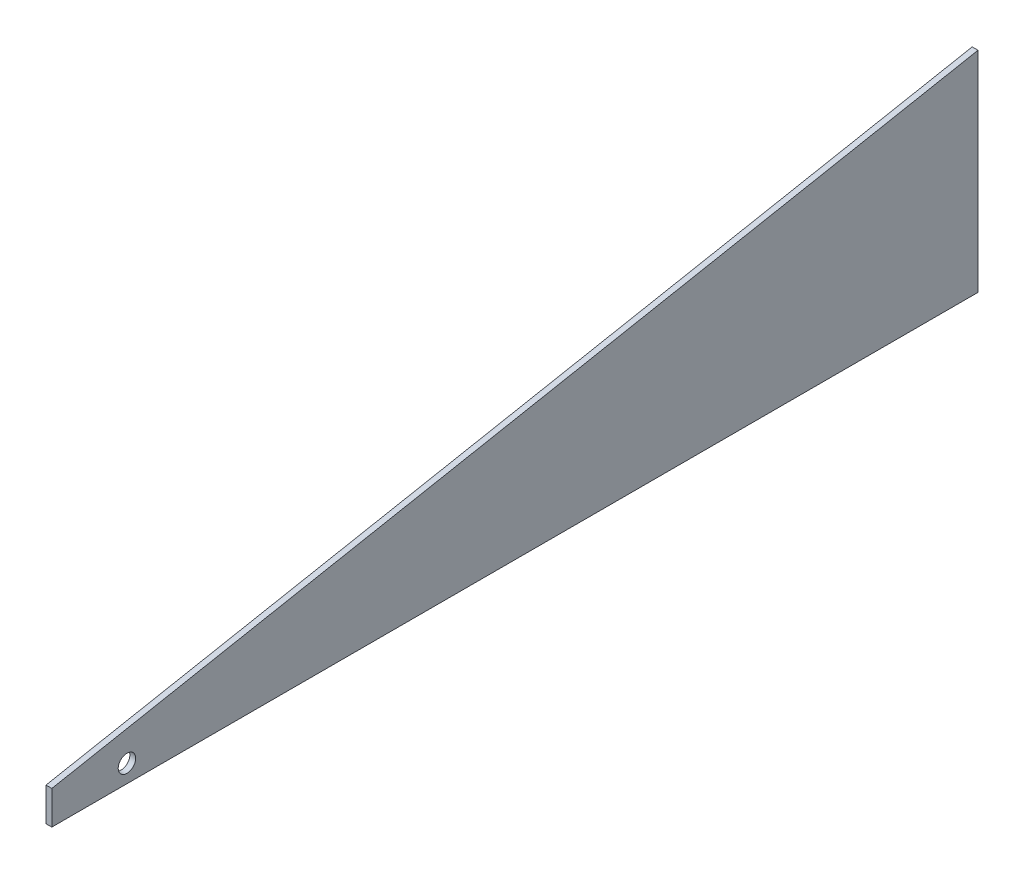
ISO-10303-21;
HEADER;
FILE_DESCRIPTION(('STEP AP214'),'2;1');
FILE_NAME('part.step','',(''),(''),'','','');
FILE_SCHEMA(('AUTOMOTIVE_DESIGN { 1 0 10303 214 1 1 1 1 }'));
ENDSEC;
DATA;
#1=APPLICATION_CONTEXT('core data for automotive mechanical design processes');
#2=APPLICATION_PROTOCOL_DEFINITION('international standard','automotive_design',2000,#1);
#3=PRODUCT_CONTEXT('',#1,'mechanical');
#4=PRODUCT('Part','Part','',(#3));
#5=PRODUCT_RELATED_PRODUCT_CATEGORY('part','',(#4));
#6=PRODUCT_DEFINITION_FORMATION('','',#4);
#7=PRODUCT_DEFINITION_CONTEXT('part definition',#1,'design');
#8=PRODUCT_DEFINITION('design','',#6,#7);
#9=PRODUCT_DEFINITION_SHAPE('','',#8);
#10=(LENGTH_UNIT() NAMED_UNIT(*) SI_UNIT(.MILLI.,.METRE.));
#11=(NAMED_UNIT(*) PLANE_ANGLE_UNIT() SI_UNIT($,.RADIAN.));
#12=(NAMED_UNIT(*) SI_UNIT($,.STERADIAN.) SOLID_ANGLE_UNIT());
#13=UNCERTAINTY_MEASURE_WITH_UNIT(LENGTH_MEASURE(1.E-05),#10,'distance_accuracy_value','');
#14=(GEOMETRIC_REPRESENTATION_CONTEXT(3) GLOBAL_UNCERTAINTY_ASSIGNED_CONTEXT((#13)) GLOBAL_UNIT_ASSIGNED_CONTEXT((#10,
#11,#12)) REPRESENTATION_CONTEXT('',''));
#15=CARTESIAN_POINT('',(0.,0.,0.));
#16=DIRECTION('',(0.,0.,1.));
#17=DIRECTION('',(1.,0.,0.));
#18=AXIS2_PLACEMENT_3D('',#15,#16,#17);
#19=CARTESIAN_POINT('',(2.,-37.5,-187.));
#20=DIRECTION('',(0.,0.,1.));
#21=DIRECTION('',(1.,0.,0.));
#22=AXIS2_PLACEMENT_3D('',#19,#20,#21);
#23=PLANE('',#22);
#24=DIRECTION('',(0.,1.,0.));
#25=VECTOR('',#24,1.);
#26=CARTESIAN_POINT('',(0.,-37.5,-187.));
#27=LINE('',#26,#25);
#28=CARTESIAN_POINT('',(0.,-37.5,-187.));
#29=VERTEX_POINT('',#28);
#30=CARTESIAN_POINT('',(0.,34.5,-187.));
#31=VERTEX_POINT('',#30);
#32=EDGE_CURVE('E99',#29,#31,#27,.T.);
#33=ORIENTED_EDGE('',*,*,#32,.T.);
#34=DIRECTION('',(-1.,0.,0.));
#35=VECTOR('',#34,1.);
#36=CARTESIAN_POINT('',(2.,34.5,-187.));
#37=LINE('',#36,#35);
#38=CARTESIAN_POINT('',(2.,34.5,-187.));
#39=VERTEX_POINT('',#38);
#40=EDGE_CURVE('E11',#39,#31,#37,.T.);
#41=ORIENTED_EDGE('',*,*,#40,.F.);
#42=DIRECTION('',(0.,1.,0.));
#43=VECTOR('',#42,1.);
#44=CARTESIAN_POINT('',(2.,-37.5,-187.));
#45=LINE('',#44,#43);
#46=CARTESIAN_POINT('',(2.,-37.5,-187.));
#47=VERTEX_POINT('',#46);
#48=EDGE_CURVE('E86',#47,#39,#45,.T.);
#49=ORIENTED_EDGE('',*,*,#48,.F.);
#50=DIRECTION('',(-1.,0.,0.));
#51=VECTOR('',#50,1.);
#52=CARTESIAN_POINT('',(2.,-37.5,-187.));
#53=LINE('',#52,#51);
#54=EDGE_CURVE('E95',#47,#29,#53,.T.);
#55=ORIENTED_EDGE('',*,*,#54,.T.);
#56=EDGE_LOOP('',(#33,#41,#49,#55));
#57=FACE_BOUND('',#56,.T.);
#58=ADVANCED_FACE('F34',(#57),#23,.F.);
#59=CARTESIAN_POINT('',(2.,-26.,131.));
#60=DIRECTION('',(0.,-0.982379102326268,-0.186899168838803));
#61=DIRECTION('',(0.,0.186899168838803,-0.982379102326268));
#62=AXIS2_PLACEMENT_3D('',#59,#60,#61);
#63=PLANE('',#62);
#64=DIRECTION('',(0.,-0.186899168838803,0.982379102326268));
#65=VECTOR('',#64,1.);
#66=CARTESIAN_POINT('',(0.,-26.,131.));
#67=LINE('',#66,#65);
#68=CARTESIAN_POINT('',(0.,-26.,131.));
#69=VERTEX_POINT('',#68);
#70=EDGE_CURVE('E90',#31,#69,#67,.T.);
#71=ORIENTED_EDGE('',*,*,#70,.T.);
#72=DIRECTION('',(-1.,0.,0.));
#73=VECTOR('',#72,1.);
#74=CARTESIAN_POINT('',(2.,-26.,131.));
#75=LINE('',#74,#73);
#76=CARTESIAN_POINT('',(2.,-26.,131.));
#77=VERTEX_POINT('',#76);
#78=EDGE_CURVE('E43',#77,#69,#75,.T.);
#79=ORIENTED_EDGE('',*,*,#78,.F.);
#80=DIRECTION('',(0.,-0.186899168838803,0.982379102326268));
#81=VECTOR('',#80,1.);
#82=CARTESIAN_POINT('',(2.,-26.,131.));
#83=LINE('',#82,#81);
#84=EDGE_CURVE('E81',#39,#77,#83,.T.);
#85=ORIENTED_EDGE('',*,*,#84,.F.);
#86=ORIENTED_EDGE('',*,*,#40,.T.);
#87=EDGE_LOOP('',(#71,#79,#85,#86));
#88=FACE_BOUND('',#87,.T.);
#89=ADVANCED_FACE('F89',(#88),#63,.F.);
#90=CARTESIAN_POINT('',(2.,-26.,131.));
#91=DIRECTION('',(0.,0.,-1.));
#92=DIRECTION('',(-1.,0.,0.));
#93=AXIS2_PLACEMENT_3D('',#90,#91,#92);
#94=PLANE('',#93);
#95=DIRECTION('',(0.,-1.,0.));
#96=VECTOR('',#95,1.);
#97=CARTESIAN_POINT('',(0.,-26.,131.));
#98=LINE('',#97,#96);
#99=CARTESIAN_POINT('',(0.,-37.5,131.));
#100=VERTEX_POINT('',#99);
#101=EDGE_CURVE('E68',#69,#100,#98,.T.);
#102=ORIENTED_EDGE('',*,*,#101,.T.);
#103=DIRECTION('',(-1.,0.,0.));
#104=VECTOR('',#103,1.);
#105=CARTESIAN_POINT('',(2.,-37.5,131.));
#106=LINE('',#105,#104);
#107=CARTESIAN_POINT('',(2.,-37.5,131.));
#108=VERTEX_POINT('',#107);
#109=EDGE_CURVE('E91',#108,#100,#106,.T.);
#110=ORIENTED_EDGE('',*,*,#109,.F.);
#111=DIRECTION('',(0.,-1.,0.));
#112=VECTOR('',#111,1.);
#113=CARTESIAN_POINT('',(2.,-26.,131.));
#114=LINE('',#113,#112);
#115=EDGE_CURVE('E84',#77,#108,#114,.T.);
#116=ORIENTED_EDGE('',*,*,#115,.F.);
#117=ORIENTED_EDGE('',*,*,#78,.T.);
#118=EDGE_LOOP('',(#102,#110,#116,#117));
#119=FACE_BOUND('',#118,.T.);
#120=ADVANCED_FACE('F93',(#119),#94,.F.);
#121=CARTESIAN_POINT('',(2.,-37.5,131.));
#122=DIRECTION('',(0.,1.,0.));
#123=DIRECTION('',(0.,0.,1.));
#124=AXIS2_PLACEMENT_3D('',#121,#122,#123);
#125=PLANE('',#124);
#126=DIRECTION('',(0.,0.,-1.));
#127=VECTOR('',#126,1.);
#128=CARTESIAN_POINT('',(0.,-37.5,131.));
#129=LINE('',#128,#127);
#130=EDGE_CURVE('E74',#100,#29,#129,.T.);
#131=ORIENTED_EDGE('',*,*,#130,.T.);
#132=ORIENTED_EDGE('',*,*,#54,.F.);
#133=DIRECTION('',(0.,0.,-1.));
#134=VECTOR('',#133,1.);
#135=CARTESIAN_POINT('',(2.,-37.5,131.));
#136=LINE('',#135,#134);
#137=EDGE_CURVE('E51',#108,#47,#136,.T.);
#138=ORIENTED_EDGE('',*,*,#137,.F.);
#139=ORIENTED_EDGE('',*,*,#109,.T.);
#140=EDGE_LOOP('',(#131,#132,#138,#139));
#141=FACE_BOUND('',#140,.T.);
#142=ADVANCED_FACE('F106',(#141),#125,.F.);
#143=CARTESIAN_POINT('',(2.,0.,0.));
#144=DIRECTION('',(-1.,0.,0.));
#145=DIRECTION('',(0.,0.,1.));
#146=AXIS2_PLACEMENT_3D('',#143,#144,#145);
#147=PLANE('',#146);
#148=CARTESIAN_POINT('',(2.,-31.4202546275172,105.202549233806));
#149=DIRECTION('',(1.,0.,0.));
#150=DIRECTION('',(0.,0.,-1.));
#151=AXIS2_PLACEMENT_3D('',#148,#149,#150);
#152=CIRCLE('',#151,3.);
#153=CARTESIAN_POINT('',(2.,-31.4202546275172,102.202549233806));
#154=VERTEX_POINT('',#153);
#155=EDGE_CURVE('E112',#154,#154,#152,.T.);
#156=ORIENTED_EDGE('',*,*,#155,.F.);
#157=EDGE_LOOP('',(#156));
#158=FACE_BOUND('',#157,.T.);
#159=ORIENTED_EDGE('',*,*,#48,.T.);
#160=ORIENTED_EDGE('',*,*,#84,.T.);
#161=ORIENTED_EDGE('',*,*,#115,.T.);
#162=ORIENTED_EDGE('',*,*,#137,.T.);
#163=EDGE_LOOP('',(#159,#160,#161,#162));
#164=FACE_BOUND('',#163,.T.);
#165=ADVANCED_FACE('F82',(#158,#164),#147,.F.);
#166=CARTESIAN_POINT('',(0.,0.,0.));
#167=DIRECTION('',(-1.,0.,0.));
#168=DIRECTION('',(0.,0.,1.));
#169=AXIS2_PLACEMENT_3D('',#166,#167,#168);
#170=PLANE('',#169);
#171=CARTESIAN_POINT('',(0.,-31.4202546275172,105.202549233806));
#172=DIRECTION('',(-1.,0.,0.));
#173=DIRECTION('',(0.,0.,1.));
#174=AXIS2_PLACEMENT_3D('',#171,#172,#173);
#175=CIRCLE('',#174,3.);
#176=CARTESIAN_POINT('',(0.,-31.4202546275172,108.202549233806));
#177=VERTEX_POINT('',#176);
#178=EDGE_CURVE('E37',#177,#177,#175,.T.);
#179=ORIENTED_EDGE('',*,*,#178,.F.);
#180=EDGE_LOOP('',(#179));
#181=FACE_BOUND('',#180,.T.);
#182=ORIENTED_EDGE('',*,*,#32,.F.);
#183=ORIENTED_EDGE('',*,*,#130,.F.);
#184=ORIENTED_EDGE('',*,*,#101,.F.);
#185=ORIENTED_EDGE('',*,*,#70,.F.);
#186=EDGE_LOOP('',(#182,#183,#184,#185));
#187=FACE_BOUND('',#186,.T.);
#188=ADVANCED_FACE('F109',(#181,#187),#170,.T.);
#189=CARTESIAN_POINT('',(2.,-31.4202546275172,105.202549233806));
#190=DIRECTION('',(1.,0.,0.));
#191=DIRECTION('',(0.,0.,-1.));
#192=AXIS2_PLACEMENT_3D('',#189,#190,#191);
#193=CYLINDRICAL_SURFACE('',#192,3.);
#194=ORIENTED_EDGE('',*,*,#178,.T.);
#195=EDGE_LOOP('',(#194));
#196=FACE_BOUND('',#195,.T.);
#197=ORIENTED_EDGE('',*,*,#155,.T.);
#198=EDGE_LOOP('',(#197));
#199=FACE_BOUND('',#198,.T.);
#200=ADVANCED_FACE('F119',(#196,#199),#193,.F.);
#201=CLOSED_SHELL('',(#58,#89,#120,#142,#165,#188,#200));
#202=MANIFOLD_SOLID_BREP('B2',#201);
#203=ADVANCED_BREP_SHAPE_REPRESENTATION('',(#18,#202),#14);
#204=SHAPE_DEFINITION_REPRESENTATION(#9,#203);
ENDSEC;
END-ISO-10303-21;
